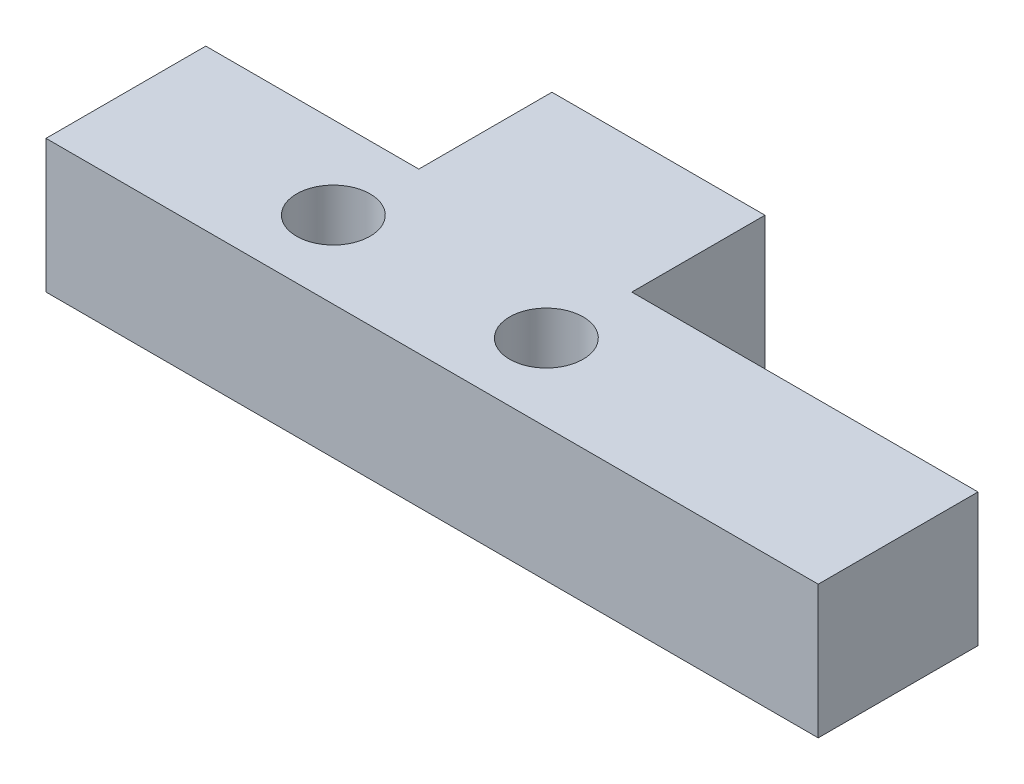
ISO-10303-21;
HEADER;
FILE_DESCRIPTION(('STEP AP214'),'2;1');
FILE_NAME('part.step','',(''),(''),'','','');
FILE_SCHEMA(('AUTOMOTIVE_DESIGN { 1 0 10303 214 1 1 1 1 }'));
ENDSEC;
DATA;
#1=APPLICATION_CONTEXT('core data for automotive mechanical design processes');
#2=APPLICATION_PROTOCOL_DEFINITION('international standard','automotive_design',2000,#1);
#3=PRODUCT_CONTEXT('',#1,'mechanical');
#4=PRODUCT('Part','Part','',(#3));
#5=PRODUCT_RELATED_PRODUCT_CATEGORY('part','',(#4));
#6=PRODUCT_DEFINITION_FORMATION('','',#4);
#7=PRODUCT_DEFINITION_CONTEXT('part definition',#1,'design');
#8=PRODUCT_DEFINITION('design','',#6,#7);
#9=PRODUCT_DEFINITION_SHAPE('','',#8);
#10=(LENGTH_UNIT() NAMED_UNIT(*) SI_UNIT(.MILLI.,.METRE.));
#11=(NAMED_UNIT(*) PLANE_ANGLE_UNIT() SI_UNIT($,.RADIAN.));
#12=(NAMED_UNIT(*) SI_UNIT($,.STERADIAN.) SOLID_ANGLE_UNIT());
#13=UNCERTAINTY_MEASURE_WITH_UNIT(LENGTH_MEASURE(1.E-05),#10,'distance_accuracy_value','');
#14=(GEOMETRIC_REPRESENTATION_CONTEXT(3) GLOBAL_UNCERTAINTY_ASSIGNED_CONTEXT((#13)) GLOBAL_UNIT_ASSIGNED_CONTEXT((#10,
#11,#12)) REPRESENTATION_CONTEXT('',''));
#15=CARTESIAN_POINT('',(0.,0.,0.));
#16=DIRECTION('',(0.,0.,1.));
#17=DIRECTION('',(1.,0.,0.));
#18=AXIS2_PLACEMENT_3D('',#15,#16,#17);
#19=CARTESIAN_POINT('',(-15.24,3.175,-3.81));
#20=DIRECTION('',(0.,0.,1.));
#21=DIRECTION('',(1.,0.,0.));
#22=AXIS2_PLACEMENT_3D('',#19,#20,#21);
#23=PLANE('',#22);
#24=DIRECTION('',(0.,1.,0.));
#25=VECTOR('',#24,1.);
#26=CARTESIAN_POINT('',(-5.08,-3.175,-3.81));
#27=LINE('',#26,#25);
#28=CARTESIAN_POINT('',(-5.08,-3.175,-3.81));
#29=VERTEX_POINT('',#28);
#30=CARTESIAN_POINT('',(-5.08,3.175,-3.81));
#31=VERTEX_POINT('',#30);
#32=EDGE_CURVE('E147',#29,#31,#27,.T.);
#33=ORIENTED_EDGE('',*,*,#32,.F.);
#34=DIRECTION('',(-1.,0.,0.));
#35=VECTOR('',#34,1.);
#36=CARTESIAN_POINT('',(-15.24,-3.175,-3.81));
#37=LINE('',#36,#35);
#38=CARTESIAN_POINT('',(-15.24,-3.175,-3.81));
#39=VERTEX_POINT('',#38);
#40=EDGE_CURVE('E103',#29,#39,#37,.T.);
#41=ORIENTED_EDGE('',*,*,#40,.T.);
#42=DIRECTION('',(0.,-1.,0.));
#43=VECTOR('',#42,1.);
#44=CARTESIAN_POINT('',(-15.24,3.175,-3.81));
#45=LINE('',#44,#43);
#46=CARTESIAN_POINT('',(-15.24,3.175,-3.81));
#47=VERTEX_POINT('',#46);
#48=EDGE_CURVE('E11',#47,#39,#45,.T.);
#49=ORIENTED_EDGE('',*,*,#48,.F.);
#50=DIRECTION('',(-1.,0.,0.));
#51=VECTOR('',#50,1.);
#52=CARTESIAN_POINT('',(-15.24,3.175,-3.81));
#53=LINE('',#52,#51);
#54=EDGE_CURVE('E95',#31,#47,#53,.T.);
#55=ORIENTED_EDGE('',*,*,#54,.F.);
#56=EDGE_LOOP('',(#33,#41,#49,#55));
#57=FACE_BOUND('',#56,.T.);
#58=ADVANCED_FACE('F33',(#57),#23,.F.);
#59=CARTESIAN_POINT('',(21.59,-3.175,-3.81));
#60=VERTEX_POINT('',#59);
#61=CARTESIAN_POINT('',(5.08,-3.175,-3.81));
#62=VERTEX_POINT('',#61);
#63=EDGE_CURVE('E80',#60,#62,#37,.T.);
#64=ORIENTED_EDGE('',*,*,#63,.T.);
#65=DIRECTION('',(0.,1.,0.));
#66=VECTOR('',#65,1.);
#67=CARTESIAN_POINT('',(5.08,-3.175,-3.81));
#68=LINE('',#67,#66);
#69=CARTESIAN_POINT('',(5.08,3.175,-3.81));
#70=VERTEX_POINT('',#69);
#71=EDGE_CURVE('E131',#62,#70,#68,.T.);
#72=ORIENTED_EDGE('',*,*,#71,.T.);
#73=CARTESIAN_POINT('',(21.59,3.175,-3.81));
#74=VERTEX_POINT('',#73);
#75=EDGE_CURVE('E97',#74,#70,#53,.T.);
#76=ORIENTED_EDGE('',*,*,#75,.F.);
#77=DIRECTION('',(0.,1.,0.));
#78=VECTOR('',#77,1.);
#79=CARTESIAN_POINT('',(21.59,-3.175,-3.81));
#80=LINE('',#79,#78);
#81=EDGE_CURVE('E130',#60,#74,#80,.T.);
#82=ORIENTED_EDGE('',*,*,#81,.F.);
#83=EDGE_LOOP('',(#64,#72,#76,#82));
#84=FACE_BOUND('',#83,.T.);
#85=ADVANCED_FACE('F35',(#84),#23,.F.);
#86=CARTESIAN_POINT('',(-15.24,3.175,3.81));
#87=DIRECTION('',(1.,0.,0.));
#88=DIRECTION('',(0.,0.,-1.));
#89=AXIS2_PLACEMENT_3D('',#86,#87,#88);
#90=PLANE('',#89);
#91=DIRECTION('',(0.,0.,1.));
#92=VECTOR('',#91,1.);
#93=CARTESIAN_POINT('',(-15.24,-3.175,3.81));
#94=LINE('',#93,#92);
#95=CARTESIAN_POINT('',(-15.24,-3.175,3.81));
#96=VERTEX_POINT('',#95);
#97=EDGE_CURVE('E71',#39,#96,#94,.T.);
#98=ORIENTED_EDGE('',*,*,#97,.T.);
#99=DIRECTION('',(0.,-1.,0.));
#100=VECTOR('',#99,1.);
#101=CARTESIAN_POINT('',(-15.24,3.175,3.81));
#102=LINE('',#101,#100);
#103=CARTESIAN_POINT('',(-15.24,3.175,3.81));
#104=VERTEX_POINT('',#103);
#105=EDGE_CURVE('E42',#104,#96,#102,.T.);
#106=ORIENTED_EDGE('',*,*,#105,.F.);
#107=DIRECTION('',(0.,0.,1.));
#108=VECTOR('',#107,1.);
#109=CARTESIAN_POINT('',(-15.24,3.175,3.81));
#110=LINE('',#109,#108);
#111=EDGE_CURVE('E59',#47,#104,#110,.T.);
#112=ORIENTED_EDGE('',*,*,#111,.F.);
#113=ORIENTED_EDGE('',*,*,#48,.T.);
#114=EDGE_LOOP('',(#98,#106,#112,#113));
#115=FACE_BOUND('',#114,.T.);
#116=ADVANCED_FACE('F73',(#115),#90,.F.);
#117=CARTESIAN_POINT('',(-15.24,3.175,3.81));
#118=DIRECTION('',(0.,0.,-1.));
#119=DIRECTION('',(-1.,0.,0.));
#120=AXIS2_PLACEMENT_3D('',#117,#118,#119);
#121=PLANE('',#120);
#122=DIRECTION('',(1.,0.,0.));
#123=VECTOR('',#122,1.);
#124=CARTESIAN_POINT('',(-15.24,-3.175,3.81));
#125=LINE('',#124,#123);
#126=CARTESIAN_POINT('',(21.59,-3.175,3.81));
#127=VERTEX_POINT('',#126);
#128=EDGE_CURVE('E79',#96,#127,#125,.T.);
#129=ORIENTED_EDGE('',*,*,#128,.T.);
#130=DIRECTION('',(0.,1.,0.));
#131=VECTOR('',#130,1.);
#132=CARTESIAN_POINT('',(21.59,-3.175,3.81));
#133=LINE('',#132,#131);
#134=CARTESIAN_POINT('',(21.59,3.175,3.81));
#135=VERTEX_POINT('',#134);
#136=EDGE_CURVE('E137',#127,#135,#133,.T.);
#137=ORIENTED_EDGE('',*,*,#136,.T.);
#138=DIRECTION('',(1.,0.,0.));
#139=VECTOR('',#138,1.);
#140=CARTESIAN_POINT('',(-15.24,3.175,3.81));
#141=LINE('',#140,#139);
#142=EDGE_CURVE('E88',#104,#135,#141,.T.);
#143=ORIENTED_EDGE('',*,*,#142,.F.);
#144=ORIENTED_EDGE('',*,*,#105,.T.);
#145=EDGE_LOOP('',(#129,#137,#143,#144));
#146=FACE_BOUND('',#145,.T.);
#147=ADVANCED_FACE('F84',(#146),#121,.F.);
#148=CARTESIAN_POINT('',(15.24,3.175,-3.81));
#149=DIRECTION('',(0.,-1.,0.));
#150=DIRECTION('',(0.,0.,-1.));
#151=AXIS2_PLACEMENT_3D('',#148,#149,#150);
#152=PLANE('',#151);
#153=CARTESIAN_POINT('',(-5.21844920480408,3.175,0.127000000000016));
#154=DIRECTION('',(0.,-1.,0.));
#155=DIRECTION('',(0.,0.,-1.));
#156=AXIS2_PLACEMENT_3D('',#153,#154,#155);
#157=CIRCLE('',#156,1.7526);
#158=CARTESIAN_POINT('',(-5.21844920480408,3.175,-1.62559999999998));
#159=VERTEX_POINT('',#158);
#160=EDGE_CURVE('E229',#159,#159,#157,.T.);
#161=ORIENTED_EDGE('',*,*,#160,.T.);
#162=EDGE_LOOP('',(#161));
#163=FACE_BOUND('',#162,.T.);
#164=CARTESIAN_POINT('',(4.94155079519593,3.175,0.127000000000002));
#165=DIRECTION('',(0.,-1.,0.));
#166=DIRECTION('',(0.,0.,-1.));
#167=AXIS2_PLACEMENT_3D('',#164,#165,#166);
#168=CIRCLE('',#167,1.7526);
#169=CARTESIAN_POINT('',(4.94155079519593,3.175,-1.6256));
#170=VERTEX_POINT('',#169);
#171=EDGE_CURVE('E232',#170,#170,#168,.T.);
#172=ORIENTED_EDGE('',*,*,#171,.T.);
#173=EDGE_LOOP('',(#172));
#174=FACE_BOUND('',#173,.T.);
#175=ORIENTED_EDGE('',*,*,#142,.T.);
#176=DIRECTION('',(0.,0.,-1.));
#177=VECTOR('',#176,1.);
#178=CARTESIAN_POINT('',(21.59,3.175,-3.81));
#179=LINE('',#178,#177);
#180=EDGE_CURVE('E125',#135,#74,#179,.T.);
#181=ORIENTED_EDGE('',*,*,#180,.T.);
#182=ORIENTED_EDGE('',*,*,#75,.T.);
#183=DIRECTION('',(0.,0.,-1.));
#184=VECTOR('',#183,1.);
#185=CARTESIAN_POINT('',(5.08,3.175,-3.81));
#186=LINE('',#185,#184);
#187=CARTESIAN_POINT('',(5.08,3.175,-10.16));
#188=VERTEX_POINT('',#187);
#189=EDGE_CURVE('E50',#70,#188,#186,.T.);
#190=ORIENTED_EDGE('',*,*,#189,.T.);
#191=DIRECTION('',(-1.,0.,0.));
#192=VECTOR('',#191,1.);
#193=CARTESIAN_POINT('',(-5.08,3.175,-10.16));
#194=LINE('',#193,#192);
#195=CARTESIAN_POINT('',(-5.08,3.175,-10.16));
#196=VERTEX_POINT('',#195);
#197=EDGE_CURVE('E149',#188,#196,#194,.T.);
#198=ORIENTED_EDGE('',*,*,#197,.T.);
#199=DIRECTION('',(0.,0.,1.));
#200=VECTOR('',#199,1.);
#201=CARTESIAN_POINT('',(-5.08,3.175,-3.81));
#202=LINE('',#201,#200);
#203=EDGE_CURVE('E136',#196,#31,#202,.T.);
#204=ORIENTED_EDGE('',*,*,#203,.T.);
#205=ORIENTED_EDGE('',*,*,#54,.T.);
#206=ORIENTED_EDGE('',*,*,#111,.T.);
#207=EDGE_LOOP('',(#175,#181,#182,#190,#198,#204,#205,#206));
#208=FACE_BOUND('',#207,.T.);
#209=ADVANCED_FACE('F119',(#163,#174,#208),#152,.F.);
#210=CARTESIAN_POINT('',(15.24,-3.175,-3.81));
#211=DIRECTION('',(0.,-1.,0.));
#212=DIRECTION('',(0.,0.,-1.));
#213=AXIS2_PLACEMENT_3D('',#210,#211,#212);
#214=PLANE('',#213);
#215=CARTESIAN_POINT('',(-5.21844920480408,-3.175,0.127000000000016));
#216=DIRECTION('',(0.,-1.,0.));
#217=DIRECTION('',(0.,0.,-1.));
#218=AXIS2_PLACEMENT_3D('',#215,#216,#217);
#219=CIRCLE('',#218,1.7526);
#220=CARTESIAN_POINT('',(-5.21844920480408,-3.175,-1.62559999999998));
#221=VERTEX_POINT('',#220);
#222=EDGE_CURVE('E240',#221,#221,#219,.T.);
#223=ORIENTED_EDGE('',*,*,#222,.F.);
#224=EDGE_LOOP('',(#223));
#225=FACE_BOUND('',#224,.T.);
#226=CARTESIAN_POINT('',(4.94155079519593,-3.175,0.127000000000002));
#227=DIRECTION('',(0.,-1.,0.));
#228=DIRECTION('',(0.,0.,-1.));
#229=AXIS2_PLACEMENT_3D('',#226,#227,#228);
#230=CIRCLE('',#229,1.7526);
#231=CARTESIAN_POINT('',(4.94155079519593,-3.175,-1.6256));
#232=VERTEX_POINT('',#231);
#233=EDGE_CURVE('E234',#232,#232,#230,.T.);
#234=ORIENTED_EDGE('',*,*,#233,.F.);
#235=EDGE_LOOP('',(#234));
#236=FACE_BOUND('',#235,.T.);
#237=ORIENTED_EDGE('',*,*,#63,.F.);
#238=DIRECTION('',(0.,0.,-1.));
#239=VECTOR('',#238,1.);
#240=CARTESIAN_POINT('',(21.59,-3.175,-3.81));
#241=LINE('',#240,#239);
#242=EDGE_CURVE('E94',#127,#60,#241,.T.);
#243=ORIENTED_EDGE('',*,*,#242,.F.);
#244=ORIENTED_EDGE('',*,*,#128,.F.);
#245=ORIENTED_EDGE('',*,*,#97,.F.);
#246=ORIENTED_EDGE('',*,*,#40,.F.);
#247=DIRECTION('',(0.,0.,1.));
#248=VECTOR('',#247,1.);
#249=CARTESIAN_POINT('',(-5.08,-3.175,-3.81));
#250=LINE('',#249,#248);
#251=CARTESIAN_POINT('',(-5.08,-3.175,-10.16));
#252=VERTEX_POINT('',#251);
#253=EDGE_CURVE('E151',#252,#29,#250,.T.);
#254=ORIENTED_EDGE('',*,*,#253,.F.);
#255=DIRECTION('',(-1.,0.,0.));
#256=VECTOR('',#255,1.);
#257=CARTESIAN_POINT('',(-5.08,-3.175,-10.16));
#258=LINE('',#257,#256);
#259=CARTESIAN_POINT('',(5.08,-3.175,-10.16));
#260=VERTEX_POINT('',#259);
#261=EDGE_CURVE('E144',#260,#252,#258,.T.);
#262=ORIENTED_EDGE('',*,*,#261,.F.);
#263=DIRECTION('',(0.,0.,-1.));
#264=VECTOR('',#263,1.);
#265=CARTESIAN_POINT('',(5.08,-3.175,-3.81));
#266=LINE('',#265,#264);
#267=EDGE_CURVE('E148',#62,#260,#266,.T.);
#268=ORIENTED_EDGE('',*,*,#267,.F.);
#269=EDGE_LOOP('',(#237,#243,#244,#245,#246,#254,#262,#268));
#270=FACE_BOUND('',#269,.T.);
#271=ADVANCED_FACE('F92',(#225,#236,#270),#214,.T.);
#272=CARTESIAN_POINT('',(-5.08,-3.175,-3.81));
#273=DIRECTION('',(-1.,0.,0.));
#274=DIRECTION('',(0.,0.,1.));
#275=AXIS2_PLACEMENT_3D('',#272,#273,#274);
#276=PLANE('',#275);
#277=ORIENTED_EDGE('',*,*,#203,.F.);
#278=DIRECTION('',(0.,1.,0.));
#279=VECTOR('',#278,1.);
#280=CARTESIAN_POINT('',(-5.08,-3.175,-10.16));
#281=LINE('',#280,#279);
#282=EDGE_CURVE('E152',#252,#196,#281,.T.);
#283=ORIENTED_EDGE('',*,*,#282,.F.);
#284=ORIENTED_EDGE('',*,*,#253,.T.);
#285=ORIENTED_EDGE('',*,*,#32,.T.);
#286=EDGE_LOOP('',(#277,#283,#284,#285));
#287=FACE_BOUND('',#286,.T.);
#288=ADVANCED_FACE('F176',(#287),#276,.T.);
#289=CARTESIAN_POINT('',(-5.08,-3.175,-10.16));
#290=DIRECTION('',(0.,0.,-1.));
#291=DIRECTION('',(-1.,0.,0.));
#292=AXIS2_PLACEMENT_3D('',#289,#290,#291);
#293=PLANE('',#292);
#294=ORIENTED_EDGE('',*,*,#197,.F.);
#295=DIRECTION('',(0.,1.,0.));
#296=VECTOR('',#295,1.);
#297=CARTESIAN_POINT('',(5.08,-3.175,-10.16));
#298=LINE('',#297,#296);
#299=EDGE_CURVE('E155',#260,#188,#298,.T.);
#300=ORIENTED_EDGE('',*,*,#299,.F.);
#301=ORIENTED_EDGE('',*,*,#261,.T.);
#302=ORIENTED_EDGE('',*,*,#282,.T.);
#303=EDGE_LOOP('',(#294,#300,#301,#302));
#304=FACE_BOUND('',#303,.T.);
#305=ADVANCED_FACE('F197',(#304),#293,.T.);
#306=CARTESIAN_POINT('',(5.08,-3.175,-3.81));
#307=DIRECTION('',(1.,0.,0.));
#308=DIRECTION('',(0.,0.,-1.));
#309=AXIS2_PLACEMENT_3D('',#306,#307,#308);
#310=PLANE('',#309);
#311=ORIENTED_EDGE('',*,*,#189,.F.);
#312=ORIENTED_EDGE('',*,*,#71,.F.);
#313=ORIENTED_EDGE('',*,*,#267,.T.);
#314=ORIENTED_EDGE('',*,*,#299,.T.);
#315=EDGE_LOOP('',(#311,#312,#313,#314));
#316=FACE_BOUND('',#315,.T.);
#317=ADVANCED_FACE('F196',(#316),#310,.T.);
#318=CARTESIAN_POINT('',(21.59,-3.175,-3.81));
#319=DIRECTION('',(1.,0.,0.));
#320=DIRECTION('',(0.,0.,-1.));
#321=AXIS2_PLACEMENT_3D('',#318,#319,#320);
#322=PLANE('',#321);
#323=ORIENTED_EDGE('',*,*,#180,.F.);
#324=ORIENTED_EDGE('',*,*,#136,.F.);
#325=ORIENTED_EDGE('',*,*,#242,.T.);
#326=ORIENTED_EDGE('',*,*,#81,.T.);
#327=EDGE_LOOP('',(#323,#324,#325,#326));
#328=FACE_BOUND('',#327,.T.);
#329=ADVANCED_FACE('F135',(#328),#322,.T.);
#330=CARTESIAN_POINT('',(4.94155079519593,3.17505,0.127000000000002));
#331=DIRECTION('',(0.,-1.,0.));
#332=DIRECTION('',(0.,0.,-1.));
#333=AXIS2_PLACEMENT_3D('',#330,#331,#332);
#334=CYLINDRICAL_SURFACE('',#333,1.7526);
#335=ORIENTED_EDGE('',*,*,#233,.T.);
#336=EDGE_LOOP('',(#335));
#337=FACE_BOUND('',#336,.T.);
#338=ORIENTED_EDGE('',*,*,#171,.F.);
#339=EDGE_LOOP('',(#338));
#340=FACE_BOUND('',#339,.T.);
#341=ADVANCED_FACE('F249',(#337,#340),#334,.F.);
#342=CARTESIAN_POINT('',(-5.21844920480408,3.17505,0.127000000000016));
#343=DIRECTION('',(0.,-1.,0.));
#344=DIRECTION('',(0.,0.,-1.));
#345=AXIS2_PLACEMENT_3D('',#342,#343,#344);
#346=CYLINDRICAL_SURFACE('',#345,1.7526);
#347=ORIENTED_EDGE('',*,*,#222,.T.);
#348=EDGE_LOOP('',(#347));
#349=FACE_BOUND('',#348,.T.);
#350=ORIENTED_EDGE('',*,*,#160,.F.);
#351=EDGE_LOOP('',(#350));
#352=FACE_BOUND('',#351,.T.);
#353=ADVANCED_FACE('F244',(#349,#352),#346,.F.);
#354=CLOSED_SHELL('',(#58,#85,#116,#147,#209,#271,#288,#305,#317,#329,#341,#353));
#355=MANIFOLD_SOLID_BREP('B2',#354);
#356=ADVANCED_BREP_SHAPE_REPRESENTATION('',(#18,#355),#14);
#357=SHAPE_DEFINITION_REPRESENTATION(#9,#356);
ENDSEC;
END-ISO-10303-21;
